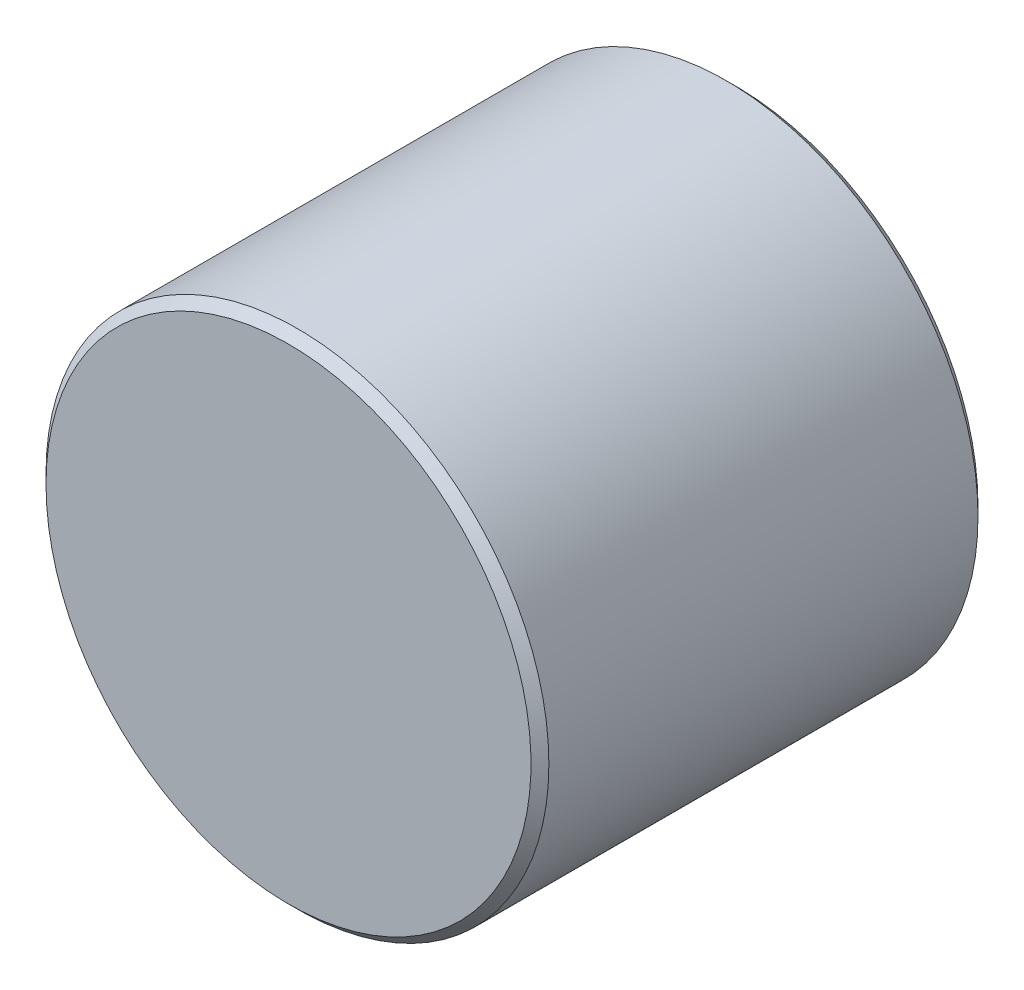
ISO-10303-21;
HEADER;
FILE_DESCRIPTION(('STEP AP214'),'2;1');
FILE_NAME('part.step','',(''),(''),'','','');
FILE_SCHEMA(('AUTOMOTIVE_DESIGN { 1 0 10303 214 1 1 1 1 }'));
ENDSEC;
DATA;
#1=APPLICATION_CONTEXT('core data for automotive mechanical design processes');
#2=APPLICATION_PROTOCOL_DEFINITION('international standard','automotive_design',2000,#1);
#3=PRODUCT_CONTEXT('',#1,'mechanical');
#4=PRODUCT('Part','Part','',(#3));
#5=PRODUCT_RELATED_PRODUCT_CATEGORY('part','',(#4));
#6=PRODUCT_DEFINITION_FORMATION('','',#4);
#7=PRODUCT_DEFINITION_CONTEXT('part definition',#1,'design');
#8=PRODUCT_DEFINITION('design','',#6,#7);
#9=PRODUCT_DEFINITION_SHAPE('','',#8);
#10=(LENGTH_UNIT() NAMED_UNIT(*) SI_UNIT(.MILLI.,.METRE.));
#11=(NAMED_UNIT(*) PLANE_ANGLE_UNIT() SI_UNIT($,.RADIAN.));
#12=(NAMED_UNIT(*) SI_UNIT($,.STERADIAN.) SOLID_ANGLE_UNIT());
#13=UNCERTAINTY_MEASURE_WITH_UNIT(LENGTH_MEASURE(1.E-05),#10,'distance_accuracy_value','');
#14=(GEOMETRIC_REPRESENTATION_CONTEXT(3) GLOBAL_UNCERTAINTY_ASSIGNED_CONTEXT((#13)) GLOBAL_UNIT_ASSIGNED_CONTEXT((#10,
#11,#12)) REPRESENTATION_CONTEXT('',''));
#15=CARTESIAN_POINT('',(0.,0.,0.));
#16=DIRECTION('',(0.,0.,1.));
#17=DIRECTION('',(1.,0.,0.));
#18=AXIS2_PLACEMENT_3D('',#15,#16,#17);
#19=CARTESIAN_POINT('',(0.,0.,0.));
#20=DIRECTION('',(0.,0.,1.));
#21=DIRECTION('',(1.,0.,0.));
#22=AXIS2_PLACEMENT_3D('',#19,#20,#21);
#23=PLANE('',#22);
#24=CARTESIAN_POINT('',(0.,0.,0.));
#25=DIRECTION('',(0.,0.,1.));
#26=DIRECTION('',(1.,0.,0.));
#27=AXIS2_PLACEMENT_3D('',#24,#25,#26);
#28=CIRCLE('',#27,6.88975000002756);
#29=CARTESIAN_POINT('',(6.88975000002756,0.,0.));
#30=VERTEX_POINT('',#29);
#31=EDGE_CURVE('E16',#30,#30,#28,.T.);
#32=ORIENTED_EDGE('',*,*,#31,.F.);
#33=EDGE_LOOP('',(#32));
#34=FACE_BOUND('',#33,.T.);
#35=ADVANCED_FACE('F13',(#34),#23,.F.);
#36=CARTESIAN_POINT('',(0.,0.,12.7));
#37=DIRECTION('',(0.,0.,1.));
#38=DIRECTION('',(1.,0.,0.));
#39=AXIS2_PLACEMENT_3D('',#36,#37,#38);
#40=PLANE('',#39);
#41=CARTESIAN_POINT('',(0.,0.,12.7000000000521));
#42=DIRECTION('',(0.,0.,-1.));
#43=DIRECTION('',(-1.,0.,0.));
#44=AXIS2_PLACEMENT_3D('',#41,#42,#43);
#45=CIRCLE('',#44,6.88974999991387);
#46=CARTESIAN_POINT('',(-6.88974999991387,0.,12.7000000000521));
#47=VERTEX_POINT('',#46);
#48=EDGE_CURVE('E25',#47,#47,#45,.T.);
#49=ORIENTED_EDGE('',*,*,#48,.F.);
#50=EDGE_LOOP('',(#49));
#51=FACE_BOUND('',#50,.T.);
#52=ADVANCED_FACE('F36',(#51),#40,.T.);
#53=CARTESIAN_POINT('',(0.,0.,0.253999999870302));
#54=DIRECTION('',(0.,0.,1.));
#55=DIRECTION('',(1.,0.,0.));
#56=AXIS2_PLACEMENT_3D('',#53,#54,#55);
#57=CONICAL_SURFACE('',#56,7.14374999989786,0.785398163397448);
#58=CARTESIAN_POINT('',(0.,0.,0.254));
#59=DIRECTION('',(0.,0.,1.));
#60=DIRECTION('',(1.,0.,0.));
#61=AXIS2_PLACEMENT_3D('',#58,#59,#60);
#62=CIRCLE('',#61,7.14375);
#63=CARTESIAN_POINT('',(7.14375,0.,0.254));
#64=VERTEX_POINT('',#63);
#65=EDGE_CURVE('E20',#64,#64,#62,.T.);
#66=ORIENTED_EDGE('',*,*,#65,.F.);
#67=EDGE_LOOP('',(#66));
#68=FACE_BOUND('',#67,.T.);
#69=ORIENTED_EDGE('',*,*,#31,.T.);
#70=EDGE_LOOP('',(#69));
#71=FACE_BOUND('',#70,.T.);
#72=ADVANCED_FACE('F33',(#68,#71),#57,.T.);
#73=CARTESIAN_POINT('',(0.,0.,12.4460000000113));
#74=DIRECTION('',(0.,0.,-1.));
#75=DIRECTION('',(-1.,0.,0.));
#76=AXIS2_PLACEMENT_3D('',#73,#74,#75);
#77=CONICAL_SURFACE('',#76,7.14374999989786,0.785398163285552);
#78=CARTESIAN_POINT('',(0.,0.,12.446));
#79=DIRECTION('',(0.,0.,1.));
#80=DIRECTION('',(1.,0.,0.));
#81=AXIS2_PLACEMENT_3D('',#78,#79,#80);
#82=CIRCLE('',#81,7.14375);
#83=CARTESIAN_POINT('',(7.14375,0.,12.446));
#84=VERTEX_POINT('',#83);
#85=EDGE_CURVE('E9',#84,#84,#82,.F.);
#86=ORIENTED_EDGE('',*,*,#85,.F.);
#87=EDGE_LOOP('',(#86));
#88=FACE_BOUND('',#87,.T.);
#89=ORIENTED_EDGE('',*,*,#48,.T.);
#90=EDGE_LOOP('',(#89));
#91=FACE_BOUND('',#90,.T.);
#92=ADVANCED_FACE('F44',(#88,#91),#77,.T.);
#93=CARTESIAN_POINT('',(0.,0.,0.));
#94=DIRECTION('',(0.,0.,1.));
#95=DIRECTION('',(1.,0.,0.));
#96=AXIS2_PLACEMENT_3D('',#93,#94,#95);
#97=CYLINDRICAL_SURFACE('',#96,7.14375);
#98=ORIENTED_EDGE('',*,*,#65,.T.);
#99=EDGE_LOOP('',(#98));
#100=FACE_BOUND('',#99,.T.);
#101=ORIENTED_EDGE('',*,*,#85,.T.);
#102=EDGE_LOOP('',(#101));
#103=FACE_BOUND('',#102,.T.);
#104=ADVANCED_FACE('F42',(#100,#103),#97,.T.);
#105=CLOSED_SHELL('',(#35,#52,#72,#92,#104));
#106=MANIFOLD_SOLID_BREP('B1',#105);
#107=ADVANCED_BREP_SHAPE_REPRESENTATION('',(#18,#106),#14);
#108=SHAPE_DEFINITION_REPRESENTATION(#9,#107);
ENDSEC;
END-ISO-10303-21;
